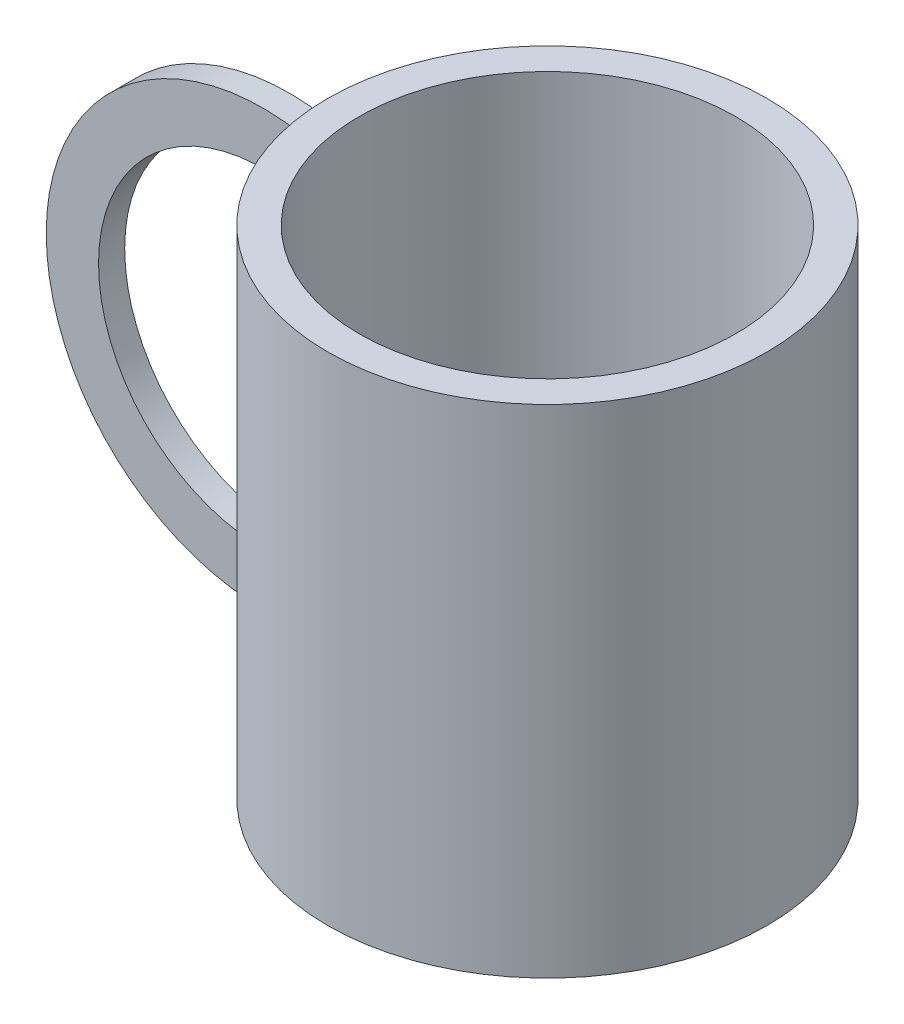
ISO-10303-21;
HEADER;
FILE_DESCRIPTION(('STEP AP214'),'2;1');
FILE_NAME('part.step','',(''),(''),'','','');
FILE_SCHEMA(('AUTOMOTIVE_DESIGN { 1 0 10303 214 1 1 1 1 }'));
ENDSEC;
DATA;
#1=APPLICATION_CONTEXT('core data for automotive mechanical design processes');
#2=APPLICATION_PROTOCOL_DEFINITION('international standard','automotive_design',2000,#1);
#3=PRODUCT_CONTEXT('',#1,'mechanical');
#4=PRODUCT('Part','Part','',(#3));
#5=PRODUCT_RELATED_PRODUCT_CATEGORY('part','',(#4));
#6=PRODUCT_DEFINITION_FORMATION('','',#4);
#7=PRODUCT_DEFINITION_CONTEXT('part definition',#1,'design');
#8=PRODUCT_DEFINITION('design','',#6,#7);
#9=PRODUCT_DEFINITION_SHAPE('','',#8);
#10=(LENGTH_UNIT() NAMED_UNIT(*) SI_UNIT(.MILLI.,.METRE.));
#11=(NAMED_UNIT(*) PLANE_ANGLE_UNIT() SI_UNIT($,.RADIAN.));
#12=(NAMED_UNIT(*) SI_UNIT($,.STERADIAN.) SOLID_ANGLE_UNIT());
#13=UNCERTAINTY_MEASURE_WITH_UNIT(LENGTH_MEASURE(1.E-05),#10,'distance_accuracy_value','');
#14=(GEOMETRIC_REPRESENTATION_CONTEXT(3) GLOBAL_UNCERTAINTY_ASSIGNED_CONTEXT((#13)) GLOBAL_UNIT_ASSIGNED_CONTEXT((#10,
#11,#12)) REPRESENTATION_CONTEXT('',''));
#15=CARTESIAN_POINT('',(0.,0.,0.));
#16=DIRECTION('',(0.,0.,1.));
#17=DIRECTION('',(1.,0.,0.));
#18=AXIS2_PLACEMENT_3D('',#15,#16,#17);
#19=CARTESIAN_POINT('',(0.,95.,0.));
#20=DIRECTION('',(0.,-1.,0.));
#21=DIRECTION('',(0.,0.,-1.));
#22=AXIS2_PLACEMENT_3D('',#19,#20,#21);
#23=CYLINDRICAL_SURFACE('',#22,36.);
#24=CARTESIAN_POINT('',(0.,95.,0.));
#25=DIRECTION('',(0.,1.,0.));
#26=DIRECTION('',(0.,0.,1.));
#27=AXIS2_PLACEMENT_3D('',#24,#25,#26);
#28=CIRCLE('',#27,36.);
#29=CARTESIAN_POINT('',(0.,95.,36.));
#30=VERTEX_POINT('',#29);
#31=EDGE_CURVE('E119',#30,#30,#28,.T.);
#32=ORIENTED_EDGE('',*,*,#31,.T.);
#33=EDGE_LOOP('',(#32));
#34=FACE_BOUND('',#33,.T.);
#35=CARTESIAN_POINT('',(0.,5.,0.));
#36=DIRECTION('',(0.,-1.,0.));
#37=DIRECTION('',(0.,0.,-1.));
#38=AXIS2_PLACEMENT_3D('',#35,#36,#37);
#39=CIRCLE('',#38,36.);
#40=CARTESIAN_POINT('',(0.,5.,-36.));
#41=VERTEX_POINT('',#40);
#42=EDGE_CURVE('E93',#41,#41,#39,.T.);
#43=ORIENTED_EDGE('',*,*,#42,.T.);
#44=EDGE_LOOP('',(#43));
#45=FACE_BOUND('',#44,.T.);
#46=ADVANCED_FACE('F33',(#34,#45),#23,.F.);
#47=CARTESIAN_POINT('',(0.,95.,0.));
#48=DIRECTION('',(0.,1.,0.));
#49=DIRECTION('',(0.,0.,1.));
#50=AXIS2_PLACEMENT_3D('',#47,#48,#49);
#51=PLANE('',#50);
#52=CARTESIAN_POINT('',(0.,95.,0.));
#53=DIRECTION('',(0.,1.,0.));
#54=DIRECTION('',(0.,0.,1.));
#55=AXIS2_PLACEMENT_3D('',#52,#53,#54);
#56=CIRCLE('',#55,42.);
#57=CARTESIAN_POINT('',(0.,95.,42.));
#58=VERTEX_POINT('',#57);
#59=EDGE_CURVE('E123',#58,#58,#56,.T.);
#60=ORIENTED_EDGE('',*,*,#59,.T.);
#61=EDGE_LOOP('',(#60));
#62=FACE_BOUND('',#61,.T.);
#63=ORIENTED_EDGE('',*,*,#31,.F.);
#64=EDGE_LOOP('',(#63));
#65=FACE_BOUND('',#64,.T.);
#66=ADVANCED_FACE('F155',(#62,#65),#51,.T.);
#67=CARTESIAN_POINT('',(0.,0.,0.));
#68=DIRECTION('',(0.,1.,0.));
#69=DIRECTION('',(0.,0.,1.));
#70=AXIS2_PLACEMENT_3D('',#67,#68,#69);
#71=PLANE('',#70);
#72=CARTESIAN_POINT('',(0.,0.,0.));
#73=DIRECTION('',(0.,1.,0.));
#74=DIRECTION('',(0.,0.,1.));
#75=AXIS2_PLACEMENT_3D('',#72,#73,#74);
#76=CIRCLE('',#75,42.);
#77=CARTESIAN_POINT('',(0.,0.,42.));
#78=VERTEX_POINT('',#77);
#79=EDGE_CURVE('E122',#78,#78,#76,.T.);
#80=ORIENTED_EDGE('',*,*,#79,.F.);
#81=EDGE_LOOP('',(#80));
#82=FACE_BOUND('',#81,.T.);
#83=ADVANCED_FACE('F158',(#82),#71,.F.);
#84=CARTESIAN_POINT('',(0.,95.,0.));
#85=DIRECTION('',(0.,-1.,0.));
#86=DIRECTION('',(0.,0.,-1.));
#87=AXIS2_PLACEMENT_3D('',#84,#85,#86);
#88=CYLINDRICAL_SURFACE('',#87,42.);
#89=CARTESIAN_POINT('',(-41.7013189239861,91.492426233647,5.));
#90=CARTESIAN_POINT('',(-41.7510566969711,91.5017607158595,4.58519192207696));
#91=CARTESIAN_POINT('',(-41.7946042109456,91.5098501671277,4.16961425179236));
#92=CARTESIAN_POINT('',(-41.8692494753771,91.5236234146751,3.33768796569206));
#93=CARTESIAN_POINT('',(-41.9003586415787,91.5293094170822,2.92134041074481));
#94=CARTESIAN_POINT('',(-41.9501495813822,91.5383770100536,2.08787816615656));
#95=CARTESIAN_POINT('',(-41.968831359684,91.5417586014895,1.67076347680576));
#96=CARTESIAN_POINT('',(-41.9937633465523,91.5462607373843,0.835766081093806));
#97=CARTESIAN_POINT('',(-42.0000020929672,91.5473791971272,0.417883021202725));
#98=CARTESIAN_POINT('',(-42.,91.5473847147409,0.));
#99=B_SPLINE_CURVE_WITH_KNOTS('',3,(#89,#90,#91,#92,#93,#94,#95,#96,#97,#98),.UNSPECIFIED.,.F.,
.F.,(4,2,2,2,4),(0.,1.25360153086498,2.50604986782895,3.75849773112526,5.01209878032061),.UNSPECIFIED.);
#100=CARTESIAN_POINT('',(-41.7013189239861,91.492426233647,5.));
#101=VERTEX_POINT('',#100);
#102=CARTESIAN_POINT('',(-42.,91.5473847147409,0.));
#103=VERTEX_POINT('',#102);
#104=EDGE_CURVE('E38',#101,#103,#99,.T.);
#105=ORIENTED_EDGE('',*,*,#104,.F.);
#106=DIRECTION('',(0.,-1.,0.));
#107=VECTOR('',#106,1.);
#108=CARTESIAN_POINT('',(-41.7013189239861,95.,5.));
#109=LINE('',#108,#107);
#110=CARTESIAN_POINT('',(-41.7013189239861,82.5758813353763,5.));
#111=VERTEX_POINT('',#110);
#112=EDGE_CURVE('E11',#101,#111,#109,.T.);
#113=ORIENTED_EDGE('',*,*,#112,.T.);
#114=CARTESIAN_POINT('',(0.,256.067175223583,0.));
#115=DIRECTION('',(0.97230660177984,-0.233708947486698,0.));
#116=DIRECTION('',(-0.233708947486698,-0.97230660177984,0.));
#117=AXIS2_PLACEMENT_3D('',#114,#115,#116);
#118=ELLIPSE('',#117,179.710706208158,42.);
#119=CARTESIAN_POINT('',(-42.,81.3332691668732,0.));
#120=VERTEX_POINT('',#119);
#121=EDGE_CURVE('E181',#111,#120,#118,.T.);
#122=ORIENTED_EDGE('',*,*,#121,.T.);
#123=DIRECTION('',(0.,-1.,0.));
#124=VECTOR('',#123,1.);
#125=CARTESIAN_POINT('',(-42.,95.,0.));
#126=LINE('',#125,#124);
#127=EDGE_CURVE('E133',#103,#120,#126,.T.);
#128=ORIENTED_EDGE('',*,*,#127,.F.);
#129=EDGE_LOOP('',(#105,#113,#122,#128));
#130=FACE_BOUND('',#129,.T.);
#131=CARTESIAN_POINT('',(0.,-154.613963120909,0.));
#132=DIRECTION('',(0.97230660177984,0.233708947486699,0.));
#133=DIRECTION('',(0.233708947486699,-0.97230660177984,0.));
#134=AXIS2_PLACEMENT_3D('',#131,#132,#133);
#135=ELLIPSE('',#134,179.710706208158,42.);
#136=CARTESIAN_POINT('',(-42.,20.1199429358001,0.));
#137=VERTEX_POINT('',#136);
#138=CARTESIAN_POINT('',(-41.7013189239861,18.8773307672969,5.));
#139=VERTEX_POINT('',#138);
#140=EDGE_CURVE('E88',#137,#139,#135,.T.);
#141=ORIENTED_EDGE('',*,*,#140,.T.);
#142=CARTESIAN_POINT('',(-41.7013189239861,9.96078586902641,5.));
#143=VERTEX_POINT('',#142);
#144=EDGE_CURVE('E49',#139,#143,#109,.T.);
#145=ORIENTED_EDGE('',*,*,#144,.T.);
#146=CARTESIAN_POINT('',(-42.,9.90582738793249,0.));
#147=CARTESIAN_POINT('',(-42.0000020929672,9.90583290554619,0.417883021202726));
#148=CARTESIAN_POINT('',(-41.9937633465523,9.90695136528911,0.835766081093806));
#149=CARTESIAN_POINT('',(-41.968831359684,9.91145350118386,1.67076347680575));
#150=CARTESIAN_POINT('',(-41.9501495813822,9.91483509261975,2.08787816615656));
#151=CARTESIAN_POINT('',(-41.9003586415787,9.92390268559118,2.92134041074481));
#152=CARTESIAN_POINT('',(-41.8692494753771,9.92958868799823,3.33768796569206));
#153=CARTESIAN_POINT('',(-41.7946042109456,9.94336193554569,4.16961425179236));
#154=CARTESIAN_POINT('',(-41.7510566969711,9.95145138681387,4.58519192207696));
#155=CARTESIAN_POINT('',(-41.7013189239861,9.96078586902641,5.));
#156=B_SPLINE_CURVE_WITH_KNOTS('',3,(#146,#147,#148,#149,#150,#151,#152,#153,#154,#155),
.UNSPECIFIED.,.F.,.F.,(4,2,2,2,4),(0.,1.25360104919535,2.50604891249166,3.75849724945563,
5.0120987803206),.UNSPECIFIED.);
#157=CARTESIAN_POINT('',(-42.,9.90582738793249,0.));
#158=VERTEX_POINT('',#157);
#159=EDGE_CURVE('E135',#158,#143,#156,.T.);
#160=ORIENTED_EDGE('',*,*,#159,.F.);
#161=EDGE_CURVE('E126',#137,#158,#126,.T.);
#162=ORIENTED_EDGE('',*,*,#161,.F.);
#163=EDGE_LOOP('',(#141,#145,#160,#162));
#164=FACE_BOUND('',#163,.T.);
#165=ORIENTED_EDGE('',*,*,#79,.T.);
#166=EDGE_LOOP('',(#165));
#167=FACE_BOUND('',#166,.T.);
#168=ORIENTED_EDGE('',*,*,#59,.F.);
#169=EDGE_LOOP('',(#168));
#170=FACE_BOUND('',#169,.T.);
#171=ADVANCED_FACE('F35',(#130,#164,#167,#170),#88,.T.);
#172=CARTESIAN_POINT('',(0.,5.,0.));
#173=DIRECTION('',(0.,-1.,0.));
#174=DIRECTION('',(0.,0.,-1.));
#175=AXIS2_PLACEMENT_3D('',#172,#173,#174);
#176=PLANE('',#175);
#177=ORIENTED_EDGE('',*,*,#42,.F.);
#178=EDGE_LOOP('',(#177));
#179=FACE_BOUND('',#178,.T.);
#180=ADVANCED_FACE('F146',(#179),#176,.F.);
#181=CARTESIAN_POINT('',(-49.356785410814,50.7266060513367,5.));
#182=DIRECTION('',(0.,0.,-1.));
#183=DIRECTION('',(-1.,0.,0.));
#184=AXIS2_PLACEMENT_3D('',#181,#182,#183);
#185=CYLINDRICAL_SURFACE('',#184,41.4784071809345);
#186=CARTESIAN_POINT('',(-49.356785410814,50.7266060513367,5.));
#187=DIRECTION('',(0.,0.,1.));
#188=DIRECTION('',(1.,0.,0.));
#189=AXIS2_PLACEMENT_3D('',#186,#187,#188);
#190=CIRCLE('',#189,41.4784071809345);
#191=EDGE_CURVE('E103',#101,#143,#190,.T.);
#192=ORIENTED_EDGE('',*,*,#191,.F.);
#193=ORIENTED_EDGE('',*,*,#104,.T.);
#194=CARTESIAN_POINT('',(-49.356785410814,50.7266060513367,0.));
#195=DIRECTION('',(0.,0.,1.));
#196=DIRECTION('',(1.,0.,0.));
#197=AXIS2_PLACEMENT_3D('',#194,#195,#196);
#198=CIRCLE('',#197,41.4784071809345);
#199=EDGE_CURVE('E113',#103,#158,#198,.T.);
#200=ORIENTED_EDGE('',*,*,#199,.T.);
#201=ORIENTED_EDGE('',*,*,#159,.T.);
#202=EDGE_LOOP('',(#192,#193,#200,#201));
#203=FACE_BOUND('',#202,.T.);
#204=ADVANCED_FACE('F141',(#203),#185,.T.);
#205=CARTESIAN_POINT('',(-49.356785410814,50.7266060513367,5.));
#206=DIRECTION('',(0.,0.,1.));
#207=DIRECTION('',(1.,0.,0.));
#208=AXIS2_PLACEMENT_3D('',#205,#206,#207);
#209=PLANE('',#208);
#210=ORIENTED_EDGE('',*,*,#112,.F.);
#211=ORIENTED_EDGE('',*,*,#191,.T.);
#212=ORIENTED_EDGE('',*,*,#144,.F.);
#213=DIRECTION('',(0.233708947486699,-0.97230660177984,0.));
#214=VECTOR('',#213,1.);
#215=CARTESIAN_POINT('',(-42.,20.1199429358001,5.));
#216=LINE('',#215,#214);
#217=CARTESIAN_POINT('',(-42.,20.1199429358001,5.));
#218=VERTEX_POINT('',#217);
#219=EDGE_CURVE('E87',#218,#139,#216,.T.);
#220=ORIENTED_EDGE('',*,*,#219,.F.);
#221=CARTESIAN_POINT('',(-49.356785410814,50.7266060513367,5.));
#222=DIRECTION('',(0.,0.,1.));
#223=DIRECTION('',(1.,0.,0.));
#224=AXIS2_PLACEMENT_3D('',#221,#222,#223);
#225=CIRCLE('',#224,31.4784071809345);
#226=CARTESIAN_POINT('',(-42.,81.3332691668732,5.));
#227=VERTEX_POINT('',#226);
#228=EDGE_CURVE('E101',#227,#218,#225,.T.);
#229=ORIENTED_EDGE('',*,*,#228,.F.);
#230=DIRECTION('',(-0.233708947486698,-0.97230660177984,0.));
#231=VECTOR('',#230,1.);
#232=CARTESIAN_POINT('',(-39.662910525133,91.0563351846716,5.));
#233=LINE('',#232,#231);
#234=EDGE_CURVE('E108',#111,#227,#233,.T.);
#235=ORIENTED_EDGE('',*,*,#234,.F.);
#236=EDGE_LOOP('',(#210,#211,#212,#220,#229,#235));
#237=FACE_BOUND('',#236,.T.);
#238=ADVANCED_FACE('F99',(#237),#209,.T.);
#239=CARTESIAN_POINT('',(-49.356785410814,50.7266060513367,0.));
#240=DIRECTION('',(0.,0.,1.));
#241=DIRECTION('',(1.,0.,0.));
#242=AXIS2_PLACEMENT_3D('',#239,#240,#241);
#243=PLANE('',#242);
#244=ORIENTED_EDGE('',*,*,#199,.F.);
#245=ORIENTED_EDGE('',*,*,#127,.T.);
#246=CARTESIAN_POINT('',(-49.356785410814,50.7266060513367,0.));
#247=DIRECTION('',(0.,0.,1.));
#248=DIRECTION('',(1.,0.,0.));
#249=AXIS2_PLACEMENT_3D('',#246,#247,#248);
#250=CIRCLE('',#249,31.4784071809345);
#251=EDGE_CURVE('E116',#120,#137,#250,.T.);
#252=ORIENTED_EDGE('',*,*,#251,.T.);
#253=ORIENTED_EDGE('',*,*,#161,.T.);
#254=EDGE_LOOP('',(#244,#245,#252,#253));
#255=FACE_BOUND('',#254,.T.);
#256=ADVANCED_FACE('F178',(#255),#243,.F.);
#257=CARTESIAN_POINT('',(-42.,20.1199429358001,5.));
#258=DIRECTION('',(0.97230660177984,0.233708947486699,0.));
#259=DIRECTION('',(-0.233708947486699,0.97230660177984,0.));
#260=AXIS2_PLACEMENT_3D('',#257,#258,#259);
#261=PLANE('',#260);
#262=ORIENTED_EDGE('',*,*,#140,.F.);
#263=DIRECTION('',(0.,0.,-1.));
#264=VECTOR('',#263,1.);
#265=CARTESIAN_POINT('',(-42.,20.1199429358001,5.));
#266=LINE('',#265,#264);
#267=EDGE_CURVE('E84',#218,#137,#266,.T.);
#268=ORIENTED_EDGE('',*,*,#267,.F.);
#269=ORIENTED_EDGE('',*,*,#219,.T.);
#270=EDGE_LOOP('',(#262,#268,#269));
#271=FACE_BOUND('',#270,.T.);
#272=ADVANCED_FACE('F86',(#271),#261,.T.);
#273=CARTESIAN_POINT('',(-49.356785410814,50.7266060513367,5.));
#274=DIRECTION('',(0.,0.,-1.));
#275=DIRECTION('',(-1.,0.,0.));
#276=AXIS2_PLACEMENT_3D('',#273,#274,#275);
#277=CYLINDRICAL_SURFACE('',#276,31.4784071809345);
#278=ORIENTED_EDGE('',*,*,#251,.F.);
#279=DIRECTION('',(0.,0.,-1.));
#280=VECTOR('',#279,1.);
#281=CARTESIAN_POINT('',(-42.,81.3332691668732,5.));
#282=LINE('',#281,#280);
#283=EDGE_CURVE('E94',#227,#120,#282,.T.);
#284=ORIENTED_EDGE('',*,*,#283,.F.);
#285=ORIENTED_EDGE('',*,*,#228,.T.);
#286=ORIENTED_EDGE('',*,*,#267,.T.);
#287=EDGE_LOOP('',(#278,#284,#285,#286));
#288=FACE_BOUND('',#287,.T.);
#289=ADVANCED_FACE('F106',(#288),#277,.F.);
#290=CARTESIAN_POINT('',(-39.662910525133,91.0563351846716,5.));
#291=DIRECTION('',(0.97230660177984,-0.233708947486698,0.));
#292=DIRECTION('',(0.233708947486698,0.97230660177984,0.));
#293=AXIS2_PLACEMENT_3D('',#290,#291,#292);
#294=PLANE('',#293);
#295=ORIENTED_EDGE('',*,*,#121,.F.);
#296=ORIENTED_EDGE('',*,*,#234,.T.);
#297=ORIENTED_EDGE('',*,*,#283,.T.);
#298=EDGE_LOOP('',(#295,#296,#297));
#299=FACE_BOUND('',#298,.T.);
#300=ADVANCED_FACE('F183',(#299),#294,.T.);
#301=CLOSED_SHELL('',(#46,#66,#83,#171,#180,#204,#238,#256,#272,#289,#300));
#302=MANIFOLD_SOLID_BREP('B2',#301);
#303=ADVANCED_BREP_SHAPE_REPRESENTATION('',(#18,#302),#14);
#304=SHAPE_DEFINITION_REPRESENTATION(#9,#303);
ENDSEC;
END-ISO-10303-21;
